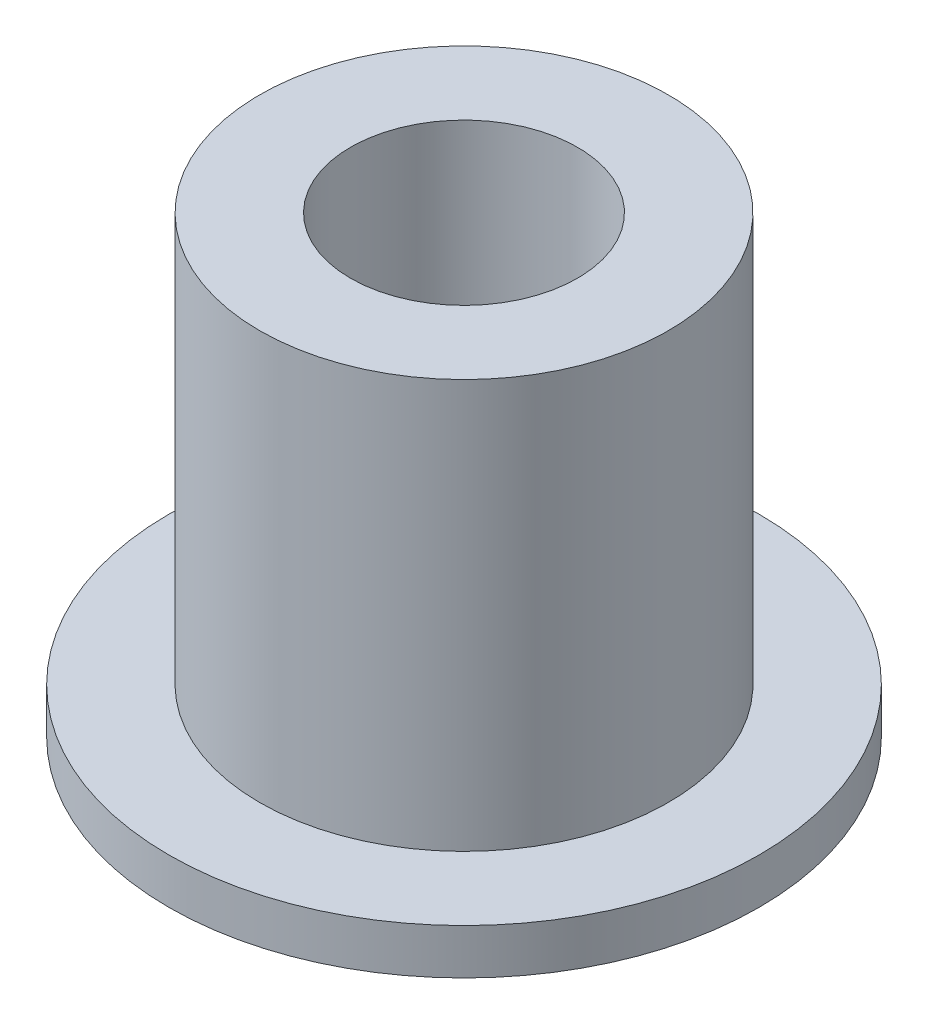
ISO-10303-21;
HEADER;
FILE_DESCRIPTION(('STEP AP214'),'2;1');
FILE_NAME('part.step','',(''),(''),'','','');
FILE_SCHEMA(('AUTOMOTIVE_DESIGN { 1 0 10303 214 1 1 1 1 }'));
ENDSEC;
DATA;
#1=APPLICATION_CONTEXT('core data for automotive mechanical design processes');
#2=APPLICATION_PROTOCOL_DEFINITION('international standard','automotive_design',2000,#1);
#3=PRODUCT_CONTEXT('',#1,'mechanical');
#4=PRODUCT('Part','Part','',(#3));
#5=PRODUCT_RELATED_PRODUCT_CATEGORY('part','',(#4));
#6=PRODUCT_DEFINITION_FORMATION('','',#4);
#7=PRODUCT_DEFINITION_CONTEXT('part definition',#1,'design');
#8=PRODUCT_DEFINITION('design','',#6,#7);
#9=PRODUCT_DEFINITION_SHAPE('','',#8);
#10=(LENGTH_UNIT() NAMED_UNIT(*) SI_UNIT(.MILLI.,.METRE.));
#11=(NAMED_UNIT(*) PLANE_ANGLE_UNIT() SI_UNIT($,.RADIAN.));
#12=(NAMED_UNIT(*) SI_UNIT($,.STERADIAN.) SOLID_ANGLE_UNIT());
#13=UNCERTAINTY_MEASURE_WITH_UNIT(LENGTH_MEASURE(1.E-05),#10,'distance_accuracy_value','');
#14=(GEOMETRIC_REPRESENTATION_CONTEXT(3) GLOBAL_UNCERTAINTY_ASSIGNED_CONTEXT((#13)) GLOBAL_UNIT_ASSIGNED_CONTEXT((#10,
#11,#12)) REPRESENTATION_CONTEXT('',''));
#15=CARTESIAN_POINT('',(0.,0.,0.));
#16=DIRECTION('',(0.,0.,1.));
#17=DIRECTION('',(1.,0.,0.));
#18=AXIS2_PLACEMENT_3D('',#15,#16,#17);
#19=CARTESIAN_POINT('',(0.,10.,0.));
#20=DIRECTION('',(0.,-1.,0.));
#21=DIRECTION('',(0.,0.,-1.));
#22=AXIS2_PLACEMENT_3D('',#19,#20,#21);
#23=CYLINDRICAL_SURFACE('',#22,2.5);
#24=CARTESIAN_POINT('',(0.,10.,0.));
#25=DIRECTION('',(0.,1.,0.));
#26=DIRECTION('',(0.,0.,1.));
#27=AXIS2_PLACEMENT_3D('',#24,#25,#26);
#28=CIRCLE('',#27,2.5);
#29=CARTESIAN_POINT('',(0.,10.,2.5));
#30=VERTEX_POINT('',#29);
#31=EDGE_CURVE('E47',#30,#30,#28,.T.);
#32=ORIENTED_EDGE('',*,*,#31,.T.);
#33=EDGE_LOOP('',(#32));
#34=FACE_BOUND('',#33,.T.);
#35=CARTESIAN_POINT('',(0.,0.,0.));
#36=DIRECTION('',(0.,1.,0.));
#37=DIRECTION('',(0.,0.,1.));
#38=AXIS2_PLACEMENT_3D('',#35,#36,#37);
#39=CIRCLE('',#38,2.5);
#40=CARTESIAN_POINT('',(0.,0.,2.5));
#41=VERTEX_POINT('',#40);
#42=EDGE_CURVE('E42',#41,#41,#39,.T.);
#43=ORIENTED_EDGE('',*,*,#42,.F.);
#44=EDGE_LOOP('',(#43));
#45=FACE_BOUND('',#44,.T.);
#46=ADVANCED_FACE('F39',(#34,#45),#23,.F.);
#47=CARTESIAN_POINT('',(0.,10.,0.));
#48=DIRECTION('',(0.,-1.,0.));
#49=DIRECTION('',(0.,0.,-1.));
#50=AXIS2_PLACEMENT_3D('',#47,#48,#49);
#51=CYLINDRICAL_SURFACE('',#50,4.5);
#52=CARTESIAN_POINT('',(0.,1.,0.));
#53=DIRECTION('',(0.,1.,0.));
#54=DIRECTION('',(0.,0.,1.));
#55=AXIS2_PLACEMENT_3D('',#52,#53,#54);
#56=CIRCLE('',#55,4.5);
#57=CARTESIAN_POINT('',(0.,1.,4.5));
#58=VERTEX_POINT('',#57);
#59=EDGE_CURVE('E58',#58,#58,#56,.T.);
#60=ORIENTED_EDGE('',*,*,#59,.T.);
#61=EDGE_LOOP('',(#60));
#62=FACE_BOUND('',#61,.T.);
#63=CARTESIAN_POINT('',(0.,10.,0.));
#64=DIRECTION('',(0.,1.,0.));
#65=DIRECTION('',(0.,0.,1.));
#66=AXIS2_PLACEMENT_3D('',#63,#64,#65);
#67=CIRCLE('',#66,4.5);
#68=CARTESIAN_POINT('',(0.,10.,4.5));
#69=VERTEX_POINT('',#68);
#70=EDGE_CURVE('E10',#69,#69,#67,.T.);
#71=ORIENTED_EDGE('',*,*,#70,.F.);
#72=EDGE_LOOP('',(#71));
#73=FACE_BOUND('',#72,.T.);
#74=ADVANCED_FACE('F67',(#62,#73),#51,.T.);
#75=CARTESIAN_POINT('',(0.,10.,0.));
#76=DIRECTION('',(0.,1.,0.));
#77=DIRECTION('',(0.,0.,1.));
#78=AXIS2_PLACEMENT_3D('',#75,#76,#77);
#79=PLANE('',#78);
#80=ORIENTED_EDGE('',*,*,#31,.F.);
#81=EDGE_LOOP('',(#80));
#82=FACE_BOUND('',#81,.T.);
#83=ORIENTED_EDGE('',*,*,#70,.T.);
#84=EDGE_LOOP('',(#83));
#85=FACE_BOUND('',#84,.T.);
#86=ADVANCED_FACE('F84',(#82,#85),#79,.T.);
#87=CARTESIAN_POINT('',(0.,0.,0.));
#88=DIRECTION('',(0.,1.,0.));
#89=DIRECTION('',(0.,0.,1.));
#90=AXIS2_PLACEMENT_3D('',#87,#88,#89);
#91=PLANE('',#90);
#92=ORIENTED_EDGE('',*,*,#42,.T.);
#93=EDGE_LOOP('',(#92));
#94=FACE_BOUND('',#93,.T.);
#95=CARTESIAN_POINT('',(0.,0.,0.));
#96=DIRECTION('',(0.,1.,0.));
#97=DIRECTION('',(0.,0.,1.));
#98=AXIS2_PLACEMENT_3D('',#95,#96,#97);
#99=CIRCLE('',#98,6.5);
#100=CARTESIAN_POINT('',(0.,0.,6.5));
#101=VERTEX_POINT('',#100);
#102=EDGE_CURVE('E54',#101,#101,#99,.T.);
#103=ORIENTED_EDGE('',*,*,#102,.F.);
#104=EDGE_LOOP('',(#103));
#105=FACE_BOUND('',#104,.T.);
#106=ADVANCED_FACE('F79',(#94,#105),#91,.F.);
#107=CARTESIAN_POINT('',(0.,1.,0.));
#108=DIRECTION('',(0.,-1.,0.));
#109=DIRECTION('',(0.,0.,-1.));
#110=AXIS2_PLACEMENT_3D('',#107,#108,#109);
#111=CYLINDRICAL_SURFACE('',#110,6.5);
#112=CARTESIAN_POINT('',(0.,1.,0.));
#113=DIRECTION('',(0.,1.,0.));
#114=DIRECTION('',(0.,0.,1.));
#115=AXIS2_PLACEMENT_3D('',#112,#113,#114);
#116=CIRCLE('',#115,6.5);
#117=CARTESIAN_POINT('',(0.,1.,6.5));
#118=VERTEX_POINT('',#117);
#119=EDGE_CURVE('E59',#118,#118,#116,.T.);
#120=ORIENTED_EDGE('',*,*,#119,.F.);
#121=EDGE_LOOP('',(#120));
#122=FACE_BOUND('',#121,.T.);
#123=ORIENTED_EDGE('',*,*,#102,.T.);
#124=EDGE_LOOP('',(#123));
#125=FACE_BOUND('',#124,.T.);
#126=ADVANCED_FACE('F73',(#122,#125),#111,.T.);
#127=CARTESIAN_POINT('',(0.,1.,0.));
#128=DIRECTION('',(0.,1.,0.));
#129=DIRECTION('',(0.,0.,1.));
#130=AXIS2_PLACEMENT_3D('',#127,#128,#129);
#131=PLANE('',#130);
#132=ORIENTED_EDGE('',*,*,#59,.F.);
#133=EDGE_LOOP('',(#132));
#134=FACE_BOUND('',#133,.T.);
#135=ORIENTED_EDGE('',*,*,#119,.T.);
#136=EDGE_LOOP('',(#135));
#137=FACE_BOUND('',#136,.T.);
#138=ADVANCED_FACE('F70',(#134,#137),#131,.T.);
#139=CLOSED_SHELL('',(#46,#74,#86,#106,#126,#138));
#140=MANIFOLD_SOLID_BREP('B2',#139);
#141=ADVANCED_BREP_SHAPE_REPRESENTATION('',(#18,#140),#14);
#142=SHAPE_DEFINITION_REPRESENTATION(#9,#141);
ENDSEC;
END-ISO-10303-21;
